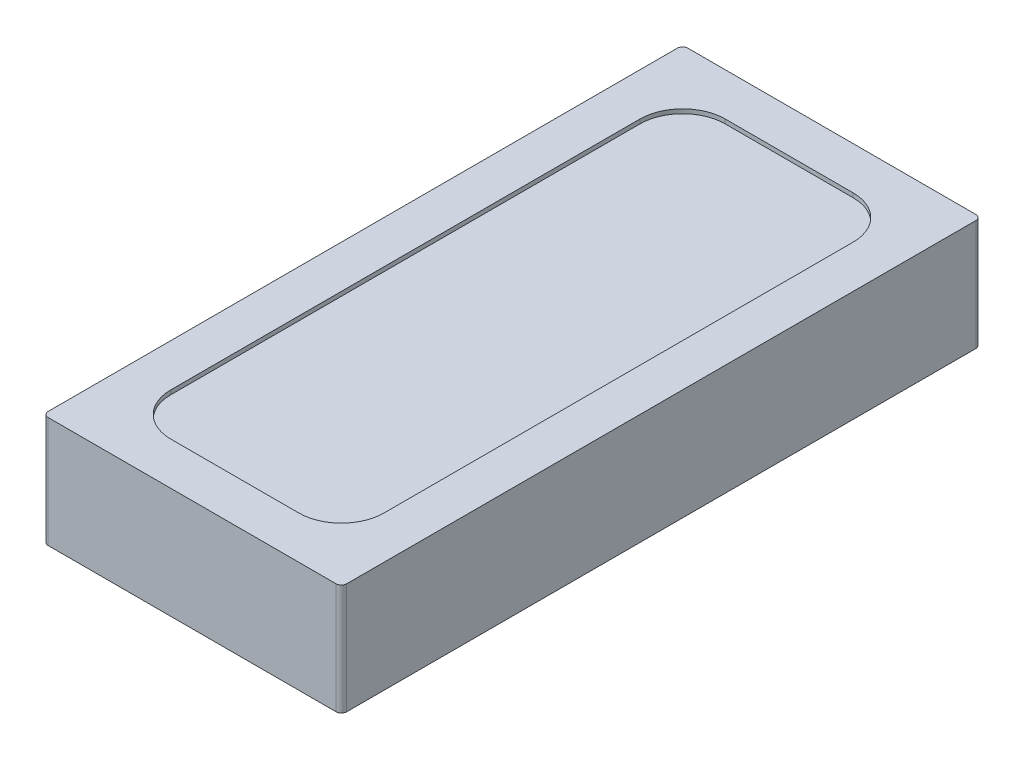
ISO-10303-21;
HEADER;
FILE_DESCRIPTION(('STEP AP214'),'2;1');
FILE_NAME('part.step','',(''),(''),'','','');
FILE_SCHEMA(('AUTOMOTIVE_DESIGN { 1 0 10303 214 1 1 1 1 }'));
ENDSEC;
DATA;
#1=APPLICATION_CONTEXT('core data for automotive mechanical design processes');
#2=APPLICATION_PROTOCOL_DEFINITION('international standard','automotive_design',2000,#1);
#3=PRODUCT_CONTEXT('',#1,'mechanical');
#4=PRODUCT('Part','Part','',(#3));
#5=PRODUCT_RELATED_PRODUCT_CATEGORY('part','',(#4));
#6=PRODUCT_DEFINITION_FORMATION('','',#4);
#7=PRODUCT_DEFINITION_CONTEXT('part definition',#1,'design');
#8=PRODUCT_DEFINITION('design','',#6,#7);
#9=PRODUCT_DEFINITION_SHAPE('','',#8);
#10=(LENGTH_UNIT() NAMED_UNIT(*) SI_UNIT(.MILLI.,.METRE.));
#11=(NAMED_UNIT(*) PLANE_ANGLE_UNIT() SI_UNIT($,.RADIAN.));
#12=(NAMED_UNIT(*) SI_UNIT($,.STERADIAN.) SOLID_ANGLE_UNIT());
#13=UNCERTAINTY_MEASURE_WITH_UNIT(LENGTH_MEASURE(1.E-05),#10,'distance_accuracy_value','');
#14=(GEOMETRIC_REPRESENTATION_CONTEXT(3) GLOBAL_UNCERTAINTY_ASSIGNED_CONTEXT((#13)) GLOBAL_UNIT_ASSIGNED_CONTEXT((#10,
#11,#12)) REPRESENTATION_CONTEXT('',''));
#15=CARTESIAN_POINT('',(0.,0.,0.));
#16=DIRECTION('',(0.,0.,1.));
#17=DIRECTION('',(1.,0.,0.));
#18=AXIS2_PLACEMENT_3D('',#15,#16,#17);
#19=CARTESIAN_POINT('',(-0.675,0.52,-1.475));
#20=DIRECTION('',(0.,-1.,0.));
#21=DIRECTION('',(0.,0.,-1.));
#22=AXIS2_PLACEMENT_3D('',#19,#20,#21);
#23=CYLINDRICAL_SURFACE('',#22,0.025);
#24=CARTESIAN_POINT('',(-0.675,0.,-1.475));
#25=DIRECTION('',(0.,1.,0.));
#26=DIRECTION('',(0.,0.,-1.));
#27=AXIS2_PLACEMENT_3D('',#24,#25,#26);
#28=CIRCLE('',#27,0.025);
#29=CARTESIAN_POINT('',(-0.675,0.,-1.5));
#30=VERTEX_POINT('',#29);
#31=CARTESIAN_POINT('',(-0.7,0.,-1.475));
#32=VERTEX_POINT('',#31);
#33=EDGE_CURVE('E142',#30,#32,#28,.T.);
#34=ORIENTED_EDGE('',*,*,#33,.T.);
#35=DIRECTION('',(0.,-1.,0.));
#36=VECTOR('',#35,1.);
#37=CARTESIAN_POINT('',(-0.7,0.52,-1.475));
#38=LINE('',#37,#36);
#39=CARTESIAN_POINT('',(-0.7,0.52,-1.475));
#40=VERTEX_POINT('',#39);
#41=EDGE_CURVE('E11',#40,#32,#38,.T.);
#42=ORIENTED_EDGE('',*,*,#41,.F.);
#43=CARTESIAN_POINT('',(-0.675,0.52,-1.475));
#44=DIRECTION('',(0.,1.,0.));
#45=DIRECTION('',(0.,0.,-1.));
#46=AXIS2_PLACEMENT_3D('',#43,#44,#45);
#47=CIRCLE('',#46,0.025);
#48=CARTESIAN_POINT('',(-0.675,0.52,-1.5));
#49=VERTEX_POINT('',#48);
#50=EDGE_CURVE('E158',#49,#40,#47,.T.);
#51=ORIENTED_EDGE('',*,*,#50,.F.);
#52=DIRECTION('',(0.,-1.,0.));
#53=VECTOR('',#52,1.);
#54=CARTESIAN_POINT('',(-0.675,0.52,-1.5));
#55=LINE('',#54,#53);
#56=EDGE_CURVE('E138',#49,#30,#55,.T.);
#57=ORIENTED_EDGE('',*,*,#56,.T.);
#58=EDGE_LOOP('',(#34,#42,#51,#57));
#59=FACE_BOUND('',#58,.T.);
#60=ADVANCED_FACE('F34',(#59),#23,.T.);
#61=CARTESIAN_POINT('',(-0.7,0.52,1.475));
#62=DIRECTION('',(1.,0.,0.));
#63=DIRECTION('',(0.,0.,-1.));
#64=AXIS2_PLACEMENT_3D('',#61,#62,#63);
#65=PLANE('',#64);
#66=DIRECTION('',(0.,0.,1.));
#67=VECTOR('',#66,1.);
#68=CARTESIAN_POINT('',(-0.7,0.,1.475));
#69=LINE('',#68,#67);
#70=CARTESIAN_POINT('',(-0.7,0.,1.475));
#71=VERTEX_POINT('',#70);
#72=EDGE_CURVE('E145',#32,#71,#69,.T.);
#73=ORIENTED_EDGE('',*,*,#72,.T.);
#74=DIRECTION('',(0.,-1.,0.));
#75=VECTOR('',#74,1.);
#76=CARTESIAN_POINT('',(-0.7,0.52,1.475));
#77=LINE('',#76,#75);
#78=CARTESIAN_POINT('',(-0.7,0.52,1.475));
#79=VERTEX_POINT('',#78);
#80=EDGE_CURVE('E41',#79,#71,#77,.T.);
#81=ORIENTED_EDGE('',*,*,#80,.F.);
#82=DIRECTION('',(0.,0.,1.));
#83=VECTOR('',#82,1.);
#84=CARTESIAN_POINT('',(-0.7,0.52,1.475));
#85=LINE('',#84,#83);
#86=EDGE_CURVE('E98',#40,#79,#85,.T.);
#87=ORIENTED_EDGE('',*,*,#86,.F.);
#88=ORIENTED_EDGE('',*,*,#41,.T.);
#89=EDGE_LOOP('',(#73,#81,#87,#88));
#90=FACE_BOUND('',#89,.T.);
#91=ADVANCED_FACE('F332',(#90),#65,.F.);
#92=CARTESIAN_POINT('',(-0.675,0.52,1.475));
#93=DIRECTION('',(0.,-1.,0.));
#94=DIRECTION('',(0.,0.,-1.));
#95=AXIS2_PLACEMENT_3D('',#92,#93,#94);
#96=CYLINDRICAL_SURFACE('',#95,0.025);
#97=CARTESIAN_POINT('',(-0.675,0.,1.475));
#98=DIRECTION('',(0.,1.,0.));
#99=DIRECTION('',(0.,0.,-1.));
#100=AXIS2_PLACEMENT_3D('',#97,#98,#99);
#101=CIRCLE('',#100,0.025);
#102=CARTESIAN_POINT('',(-0.675,0.,1.5));
#103=VERTEX_POINT('',#102);
#104=EDGE_CURVE('E148',#71,#103,#101,.T.);
#105=ORIENTED_EDGE('',*,*,#104,.T.);
#106=DIRECTION('',(0.,-1.,0.));
#107=VECTOR('',#106,1.);
#108=CARTESIAN_POINT('',(-0.675,0.52,1.5));
#109=LINE('',#108,#107);
#110=CARTESIAN_POINT('',(-0.675,0.52,1.5));
#111=VERTEX_POINT('',#110);
#112=EDGE_CURVE('E165',#111,#103,#109,.T.);
#113=ORIENTED_EDGE('',*,*,#112,.F.);
#114=CARTESIAN_POINT('',(-0.675,0.52,1.475));
#115=DIRECTION('',(0.,1.,0.));
#116=DIRECTION('',(0.,0.,-1.));
#117=AXIS2_PLACEMENT_3D('',#114,#115,#116);
#118=CIRCLE('',#117,0.025);
#119=EDGE_CURVE('E173',#79,#111,#118,.T.);
#120=ORIENTED_EDGE('',*,*,#119,.F.);
#121=ORIENTED_EDGE('',*,*,#80,.T.);
#122=EDGE_LOOP('',(#105,#113,#120,#121));
#123=FACE_BOUND('',#122,.T.);
#124=ADVANCED_FACE('F171',(#123),#96,.T.);
#125=CARTESIAN_POINT('',(-0.675,0.52,1.5));
#126=DIRECTION('',(0.,0.,-1.));
#127=DIRECTION('',(-1.,0.,0.));
#128=AXIS2_PLACEMENT_3D('',#125,#126,#127);
#129=PLANE('',#128);
#130=DIRECTION('',(1.,0.,0.));
#131=VECTOR('',#130,1.);
#132=CARTESIAN_POINT('',(-0.675,0.,1.5));
#133=LINE('',#132,#131);
#134=CARTESIAN_POINT('',(0.675,0.,1.5));
#135=VERTEX_POINT('',#134);
#136=EDGE_CURVE('E150',#103,#135,#133,.T.);
#137=ORIENTED_EDGE('',*,*,#136,.T.);
#138=DIRECTION('',(0.,-1.,0.));
#139=VECTOR('',#138,1.);
#140=CARTESIAN_POINT('',(0.675,0.52,1.5));
#141=LINE('',#140,#139);
#142=CARTESIAN_POINT('',(0.675,0.52,1.5));
#143=VERTEX_POINT('',#142);
#144=EDGE_CURVE('E162',#143,#135,#141,.T.);
#145=ORIENTED_EDGE('',*,*,#144,.F.);
#146=DIRECTION('',(1.,0.,0.));
#147=VECTOR('',#146,1.);
#148=CARTESIAN_POINT('',(-0.675,0.52,1.5));
#149=LINE('',#148,#147);
#150=EDGE_CURVE('E185',#111,#143,#149,.T.);
#151=ORIENTED_EDGE('',*,*,#150,.F.);
#152=ORIENTED_EDGE('',*,*,#112,.T.);
#153=EDGE_LOOP('',(#137,#145,#151,#152));
#154=FACE_BOUND('',#153,.T.);
#155=ADVANCED_FACE('F181',(#154),#129,.F.);
#156=CARTESIAN_POINT('',(0.675,0.52,1.475));
#157=DIRECTION('',(0.,-1.,0.));
#158=DIRECTION('',(0.,0.,-1.));
#159=AXIS2_PLACEMENT_3D('',#156,#157,#158);
#160=CYLINDRICAL_SURFACE('',#159,0.025);
#161=CARTESIAN_POINT('',(0.675,0.,1.475));
#162=DIRECTION('',(0.,1.,0.));
#163=DIRECTION('',(0.,0.,1.));
#164=AXIS2_PLACEMENT_3D('',#161,#162,#163);
#165=CIRCLE('',#164,0.025);
#166=CARTESIAN_POINT('',(0.7,0.,1.475));
#167=VERTEX_POINT('',#166);
#168=EDGE_CURVE('E152',#135,#167,#165,.T.);
#169=ORIENTED_EDGE('',*,*,#168,.T.);
#170=DIRECTION('',(0.,-1.,0.));
#171=VECTOR('',#170,1.);
#172=CARTESIAN_POINT('',(0.7,0.52,1.475));
#173=LINE('',#172,#171);
#174=CARTESIAN_POINT('',(0.7,0.52,1.475));
#175=VERTEX_POINT('',#174);
#176=EDGE_CURVE('E133',#175,#167,#173,.T.);
#177=ORIENTED_EDGE('',*,*,#176,.F.);
#178=CARTESIAN_POINT('',(0.675,0.52,1.475));
#179=DIRECTION('',(0.,1.,0.));
#180=DIRECTION('',(0.,0.,1.));
#181=AXIS2_PLACEMENT_3D('',#178,#179,#180);
#182=CIRCLE('',#181,0.025);
#183=EDGE_CURVE('E121',#143,#175,#182,.T.);
#184=ORIENTED_EDGE('',*,*,#183,.F.);
#185=ORIENTED_EDGE('',*,*,#144,.T.);
#186=EDGE_LOOP('',(#169,#177,#184,#185));
#187=FACE_BOUND('',#186,.T.);
#188=ADVANCED_FACE('F184',(#187),#160,.T.);
#189=CARTESIAN_POINT('',(0.7,0.52,1.475));
#190=DIRECTION('',(-1.,0.,0.));
#191=DIRECTION('',(0.,0.,1.));
#192=AXIS2_PLACEMENT_3D('',#189,#190,#191);
#193=PLANE('',#192);
#194=DIRECTION('',(0.,0.,-1.));
#195=VECTOR('',#194,1.);
#196=CARTESIAN_POINT('',(0.7,0.,1.475));
#197=LINE('',#196,#195);
#198=CARTESIAN_POINT('',(0.7,0.,-1.475));
#199=VERTEX_POINT('',#198);
#200=EDGE_CURVE('E130',#167,#199,#197,.T.);
#201=ORIENTED_EDGE('',*,*,#200,.T.);
#202=DIRECTION('',(0.,-1.,0.));
#203=VECTOR('',#202,1.);
#204=CARTESIAN_POINT('',(0.7,0.52,-1.475));
#205=LINE('',#204,#203);
#206=CARTESIAN_POINT('',(0.7,0.52,-1.475));
#207=VERTEX_POINT('',#206);
#208=EDGE_CURVE('E127',#207,#199,#205,.T.);
#209=ORIENTED_EDGE('',*,*,#208,.F.);
#210=DIRECTION('',(0.,0.,-1.));
#211=VECTOR('',#210,1.);
#212=CARTESIAN_POINT('',(0.7,0.52,1.475));
#213=LINE('',#212,#211);
#214=EDGE_CURVE('E114',#175,#207,#213,.T.);
#215=ORIENTED_EDGE('',*,*,#214,.F.);
#216=ORIENTED_EDGE('',*,*,#176,.T.);
#217=EDGE_LOOP('',(#201,#209,#215,#216));
#218=FACE_BOUND('',#217,.T.);
#219=ADVANCED_FACE('F128',(#218),#193,.F.);
#220=CARTESIAN_POINT('',(0.675,0.52,-1.475));
#221=DIRECTION('',(0.,-1.,0.));
#222=DIRECTION('',(0.,0.,-1.));
#223=AXIS2_PLACEMENT_3D('',#220,#221,#222);
#224=CYLINDRICAL_SURFACE('',#223,0.025);
#225=CARTESIAN_POINT('',(0.675,0.,-1.475));
#226=DIRECTION('',(0.,1.,0.));
#227=DIRECTION('',(0.,0.,-1.));
#228=AXIS2_PLACEMENT_3D('',#225,#226,#227);
#229=CIRCLE('',#228,0.025);
#230=CARTESIAN_POINT('',(0.675,0.,-1.5));
#231=VERTEX_POINT('',#230);
#232=EDGE_CURVE('E155',#199,#231,#229,.T.);
#233=ORIENTED_EDGE('',*,*,#232,.T.);
#234=DIRECTION('',(0.,-1.,0.));
#235=VECTOR('',#234,1.);
#236=CARTESIAN_POINT('',(0.675,0.52,-1.5));
#237=LINE('',#236,#235);
#238=CARTESIAN_POINT('',(0.675,0.52,-1.5));
#239=VERTEX_POINT('',#238);
#240=EDGE_CURVE('E134',#239,#231,#237,.T.);
#241=ORIENTED_EDGE('',*,*,#240,.F.);
#242=CARTESIAN_POINT('',(0.675,0.52,-1.475));
#243=DIRECTION('',(0.,1.,0.));
#244=DIRECTION('',(0.,0.,-1.));
#245=AXIS2_PLACEMENT_3D('',#242,#243,#244);
#246=CIRCLE('',#245,0.025);
#247=EDGE_CURVE('E118',#207,#239,#246,.T.);
#248=ORIENTED_EDGE('',*,*,#247,.F.);
#249=ORIENTED_EDGE('',*,*,#208,.T.);
#250=EDGE_LOOP('',(#233,#241,#248,#249));
#251=FACE_BOUND('',#250,.T.);
#252=ADVANCED_FACE('F136',(#251),#224,.T.);
#253=CARTESIAN_POINT('',(-0.675,0.52,-1.5));
#254=DIRECTION('',(0.,0.,1.));
#255=DIRECTION('',(1.,0.,0.));
#256=AXIS2_PLACEMENT_3D('',#253,#254,#255);
#257=PLANE('',#256);
#258=DIRECTION('',(-1.,0.,0.));
#259=VECTOR('',#258,1.);
#260=CARTESIAN_POINT('',(-0.675,0.,-1.5));
#261=LINE('',#260,#259);
#262=EDGE_CURVE('E90',#231,#30,#261,.T.);
#263=ORIENTED_EDGE('',*,*,#262,.T.);
#264=ORIENTED_EDGE('',*,*,#56,.F.);
#265=DIRECTION('',(-1.,0.,0.));
#266=VECTOR('',#265,1.);
#267=CARTESIAN_POINT('',(-0.675,0.52,-1.5));
#268=LINE('',#267,#266);
#269=EDGE_CURVE('E57',#239,#49,#268,.T.);
#270=ORIENTED_EDGE('',*,*,#269,.F.);
#271=ORIENTED_EDGE('',*,*,#240,.T.);
#272=EDGE_LOOP('',(#263,#264,#270,#271));
#273=FACE_BOUND('',#272,.T.);
#274=ADVANCED_FACE('F339',(#273),#257,.F.);
#275=CARTESIAN_POINT('',(-0.675,0.52,-1.475));
#276=DIRECTION('',(0.,-1.,0.));
#277=DIRECTION('',(0.,0.,-1.));
#278=AXIS2_PLACEMENT_3D('',#275,#276,#277);
#279=PLANE('',#278);
#280=DIRECTION('',(0.,0.,-1.));
#281=VECTOR('',#280,1.);
#282=CARTESIAN_POINT('',(0.5,0.52,1.1));
#283=LINE('',#282,#281);
#284=CARTESIAN_POINT('',(0.5,0.52,1.1));
#285=VERTEX_POINT('',#284);
#286=CARTESIAN_POINT('',(0.5,0.52,-1.1));
#287=VERTEX_POINT('',#286);
#288=EDGE_CURVE('E232',#285,#287,#283,.T.);
#289=ORIENTED_EDGE('',*,*,#288,.F.);
#290=CARTESIAN_POINT('',(0.3,0.52,1.1));
#291=DIRECTION('',(0.,1.,0.));
#292=DIRECTION('',(0.,0.,1.));
#293=AXIS2_PLACEMENT_3D('',#290,#291,#292);
#294=CIRCLE('',#293,0.2);
#295=CARTESIAN_POINT('',(0.299999999999999,0.52,1.3));
#296=VERTEX_POINT('',#295);
#297=EDGE_CURVE('E48',#296,#285,#294,.T.);
#298=ORIENTED_EDGE('',*,*,#297,.F.);
#299=DIRECTION('',(1.,0.,0.));
#300=VECTOR('',#299,1.);
#301=CARTESIAN_POINT('',(-0.299999999999999,0.52,1.3));
#302=LINE('',#301,#300);
#303=CARTESIAN_POINT('',(-0.299999999999999,0.52,1.3));
#304=VERTEX_POINT('',#303);
#305=EDGE_CURVE('E213',#304,#296,#302,.T.);
#306=ORIENTED_EDGE('',*,*,#305,.F.);
#307=CARTESIAN_POINT('',(-0.3,0.52,1.1));
#308=DIRECTION('',(0.,1.,0.));
#309=DIRECTION('',(0.,0.,-1.));
#310=AXIS2_PLACEMENT_3D('',#307,#308,#309);
#311=CIRCLE('',#310,0.2);
#312=CARTESIAN_POINT('',(-0.5,0.52,1.1));
#313=VERTEX_POINT('',#312);
#314=EDGE_CURVE('E217',#313,#304,#311,.T.);
#315=ORIENTED_EDGE('',*,*,#314,.F.);
#316=DIRECTION('',(0.,0.,1.));
#317=VECTOR('',#316,1.);
#318=CARTESIAN_POINT('',(-0.5,0.52,1.1));
#319=LINE('',#318,#317);
#320=CARTESIAN_POINT('',(-0.5,0.52,-1.1));
#321=VERTEX_POINT('',#320);
#322=EDGE_CURVE('E220',#321,#313,#319,.T.);
#323=ORIENTED_EDGE('',*,*,#322,.F.);
#324=CARTESIAN_POINT('',(-0.3,0.52,-1.1));
#325=DIRECTION('',(0.,1.,0.));
#326=DIRECTION('',(0.,0.,-1.));
#327=AXIS2_PLACEMENT_3D('',#324,#325,#326);
#328=CIRCLE('',#327,0.2);
#329=CARTESIAN_POINT('',(-0.3,0.52,-1.3));
#330=VERTEX_POINT('',#329);
#331=EDGE_CURVE('E223',#330,#321,#328,.T.);
#332=ORIENTED_EDGE('',*,*,#331,.F.);
#333=DIRECTION('',(-1.,0.,0.));
#334=VECTOR('',#333,1.);
#335=CARTESIAN_POINT('',(-0.299999999999999,0.52,-1.3));
#336=LINE('',#335,#334);
#337=CARTESIAN_POINT('',(0.299999999999999,0.52,-1.3));
#338=VERTEX_POINT('',#337);
#339=EDGE_CURVE('E226',#338,#330,#336,.T.);
#340=ORIENTED_EDGE('',*,*,#339,.F.);
#341=CARTESIAN_POINT('',(0.3,0.52,-1.1));
#342=DIRECTION('',(0.,1.,0.));
#343=DIRECTION('',(0.,0.,-1.));
#344=AXIS2_PLACEMENT_3D('',#341,#342,#343);
#345=CIRCLE('',#344,0.2);
#346=EDGE_CURVE('E229',#287,#338,#345,.T.);
#347=ORIENTED_EDGE('',*,*,#346,.F.);
#348=EDGE_LOOP('',(#289,#298,#306,#315,#323,#332,#340,#347));
#349=FACE_BOUND('',#348,.T.);
#350=ORIENTED_EDGE('',*,*,#50,.T.);
#351=ORIENTED_EDGE('',*,*,#86,.T.);
#352=ORIENTED_EDGE('',*,*,#119,.T.);
#353=ORIENTED_EDGE('',*,*,#150,.T.);
#354=ORIENTED_EDGE('',*,*,#183,.T.);
#355=ORIENTED_EDGE('',*,*,#214,.T.);
#356=ORIENTED_EDGE('',*,*,#247,.T.);
#357=ORIENTED_EDGE('',*,*,#269,.T.);
#358=EDGE_LOOP('',(#350,#351,#352,#353,#354,#355,#356,#357));
#359=FACE_BOUND('',#358,.T.);
#360=ADVANCED_FACE('F116',(#349,#359),#279,.F.);
#361=CARTESIAN_POINT('',(-0.675,0.,-1.475));
#362=DIRECTION('',(0.,-1.,0.));
#363=DIRECTION('',(0.,0.,-1.));
#364=AXIS2_PLACEMENT_3D('',#361,#362,#363);
#365=PLANE('',#364);
#366=ORIENTED_EDGE('',*,*,#33,.F.);
#367=ORIENTED_EDGE('',*,*,#262,.F.);
#368=ORIENTED_EDGE('',*,*,#232,.F.);
#369=ORIENTED_EDGE('',*,*,#200,.F.);
#370=ORIENTED_EDGE('',*,*,#168,.F.);
#371=ORIENTED_EDGE('',*,*,#136,.F.);
#372=ORIENTED_EDGE('',*,*,#104,.F.);
#373=ORIENTED_EDGE('',*,*,#72,.F.);
#374=EDGE_LOOP('',(#366,#367,#368,#369,#370,#371,#372,#373));
#375=FACE_BOUND('',#374,.T.);
#376=ADVANCED_FACE('F177',(#375),#365,.T.);
#377=CARTESIAN_POINT('',(0.3,0.5,1.1));
#378=DIRECTION('',(0.,1.,0.));
#379=DIRECTION('',(0.,0.,1.));
#380=AXIS2_PLACEMENT_3D('',#377,#378,#379);
#381=CYLINDRICAL_SURFACE('',#380,0.2);
#382=ORIENTED_EDGE('',*,*,#297,.T.);
#383=DIRECTION('',(0.,1.,0.));
#384=VECTOR('',#383,1.);
#385=CARTESIAN_POINT('',(0.5,0.5,1.1));
#386=LINE('',#385,#384);
#387=CARTESIAN_POINT('',(0.5,0.5,1.1));
#388=VERTEX_POINT('',#387);
#389=EDGE_CURVE('E191',#388,#285,#386,.T.);
#390=ORIENTED_EDGE('',*,*,#389,.F.);
#391=CARTESIAN_POINT('',(0.3,0.5,1.1));
#392=DIRECTION('',(0.,1.,0.));
#393=DIRECTION('',(0.,0.,1.));
#394=AXIS2_PLACEMENT_3D('',#391,#392,#393);
#395=CIRCLE('',#394,0.2);
#396=CARTESIAN_POINT('',(0.299999999999999,0.5,1.3));
#397=VERTEX_POINT('',#396);
#398=EDGE_CURVE('E216',#397,#388,#395,.T.);
#399=ORIENTED_EDGE('',*,*,#398,.F.);
#400=DIRECTION('',(0.,1.,0.));
#401=VECTOR('',#400,1.);
#402=CARTESIAN_POINT('',(0.299999999999999,0.5,1.3));
#403=LINE('',#402,#401);
#404=EDGE_CURVE('E146',#397,#296,#403,.T.);
#405=ORIENTED_EDGE('',*,*,#404,.T.);
#406=EDGE_LOOP('',(#382,#390,#399,#405));
#407=FACE_BOUND('',#406,.T.);
#408=ADVANCED_FACE('F265',(#407),#381,.F.);
#409=CARTESIAN_POINT('',(-0.299999999999999,0.5,1.3));
#410=DIRECTION('',(0.,0.,1.));
#411=DIRECTION('',(1.,0.,0.));
#412=AXIS2_PLACEMENT_3D('',#409,#410,#411);
#413=PLANE('',#412);
#414=ORIENTED_EDGE('',*,*,#305,.T.);
#415=ORIENTED_EDGE('',*,*,#404,.F.);
#416=DIRECTION('',(1.,0.,0.));
#417=VECTOR('',#416,1.);
#418=CARTESIAN_POINT('',(-0.299999999999999,0.5,1.3));
#419=LINE('',#418,#417);
#420=CARTESIAN_POINT('',(-0.299999999999999,0.5,1.3));
#421=VERTEX_POINT('',#420);
#422=EDGE_CURVE('E194',#421,#397,#419,.T.);
#423=ORIENTED_EDGE('',*,*,#422,.F.);
#424=DIRECTION('',(0.,1.,0.));
#425=VECTOR('',#424,1.);
#426=CARTESIAN_POINT('',(-0.299999999999999,0.5,1.3));
#427=LINE('',#426,#425);
#428=EDGE_CURVE('E209',#421,#304,#427,.T.);
#429=ORIENTED_EDGE('',*,*,#428,.T.);
#430=EDGE_LOOP('',(#414,#415,#423,#429));
#431=FACE_BOUND('',#430,.T.);
#432=ADVANCED_FACE('F285',(#431),#413,.F.);
#433=CARTESIAN_POINT('',(-0.3,0.5,1.1));
#434=DIRECTION('',(0.,1.,0.));
#435=DIRECTION('',(0.,0.,1.));
#436=AXIS2_PLACEMENT_3D('',#433,#434,#435);
#437=CYLINDRICAL_SURFACE('',#436,0.2);
#438=ORIENTED_EDGE('',*,*,#314,.T.);
#439=ORIENTED_EDGE('',*,*,#428,.F.);
#440=CARTESIAN_POINT('',(-0.3,0.5,1.1));
#441=DIRECTION('',(0.,1.,0.));
#442=DIRECTION('',(0.,0.,-1.));
#443=AXIS2_PLACEMENT_3D('',#440,#441,#442);
#444=CIRCLE('',#443,0.2);
#445=CARTESIAN_POINT('',(-0.5,0.5,1.1));
#446=VERTEX_POINT('',#445);
#447=EDGE_CURVE('E238',#446,#421,#444,.T.);
#448=ORIENTED_EDGE('',*,*,#447,.F.);
#449=DIRECTION('',(0.,1.,0.));
#450=VECTOR('',#449,1.);
#451=CARTESIAN_POINT('',(-0.5,0.5,1.1));
#452=LINE('',#451,#450);
#453=EDGE_CURVE('E206',#446,#313,#452,.T.);
#454=ORIENTED_EDGE('',*,*,#453,.T.);
#455=EDGE_LOOP('',(#438,#439,#448,#454));
#456=FACE_BOUND('',#455,.T.);
#457=ADVANCED_FACE('F290',(#456),#437,.F.);
#458=CARTESIAN_POINT('',(-0.5,0.5,1.1));
#459=DIRECTION('',(-1.,0.,0.));
#460=DIRECTION('',(0.,0.,1.));
#461=AXIS2_PLACEMENT_3D('',#458,#459,#460);
#462=PLANE('',#461);
#463=ORIENTED_EDGE('',*,*,#322,.T.);
#464=ORIENTED_EDGE('',*,*,#453,.F.);
#465=DIRECTION('',(0.,0.,1.));
#466=VECTOR('',#465,1.);
#467=CARTESIAN_POINT('',(-0.5,0.5,1.1));
#468=LINE('',#467,#466);
#469=CARTESIAN_POINT('',(-0.5,0.5,-1.1));
#470=VERTEX_POINT('',#469);
#471=EDGE_CURVE('E241',#470,#446,#468,.T.);
#472=ORIENTED_EDGE('',*,*,#471,.F.);
#473=DIRECTION('',(0.,1.,0.));
#474=VECTOR('',#473,1.);
#475=CARTESIAN_POINT('',(-0.5,0.5,-1.1));
#476=LINE('',#475,#474);
#477=EDGE_CURVE('E203',#470,#321,#476,.T.);
#478=ORIENTED_EDGE('',*,*,#477,.T.);
#479=EDGE_LOOP('',(#463,#464,#472,#478));
#480=FACE_BOUND('',#479,.T.);
#481=ADVANCED_FACE('F316',(#480),#462,.F.);
#482=CARTESIAN_POINT('',(-0.3,0.5,-1.1));
#483=DIRECTION('',(0.,1.,0.));
#484=DIRECTION('',(0.,0.,1.));
#485=AXIS2_PLACEMENT_3D('',#482,#483,#484);
#486=CYLINDRICAL_SURFACE('',#485,0.2);
#487=ORIENTED_EDGE('',*,*,#331,.T.);
#488=ORIENTED_EDGE('',*,*,#477,.F.);
#489=CARTESIAN_POINT('',(-0.3,0.5,-1.1));
#490=DIRECTION('',(0.,1.,0.));
#491=DIRECTION('',(0.,0.,-1.));
#492=AXIS2_PLACEMENT_3D('',#489,#490,#491);
#493=CIRCLE('',#492,0.2);
#494=CARTESIAN_POINT('',(-0.3,0.5,-1.3));
#495=VERTEX_POINT('',#494);
#496=EDGE_CURVE('E244',#495,#470,#493,.T.);
#497=ORIENTED_EDGE('',*,*,#496,.F.);
#498=DIRECTION('',(0.,1.,0.));
#499=VECTOR('',#498,1.);
#500=CARTESIAN_POINT('',(-0.3,0.5,-1.3));
#501=LINE('',#500,#499);
#502=EDGE_CURVE('E200',#495,#330,#501,.T.);
#503=ORIENTED_EDGE('',*,*,#502,.T.);
#504=EDGE_LOOP('',(#487,#488,#497,#503));
#505=FACE_BOUND('',#504,.T.);
#506=ADVANCED_FACE('F319',(#505),#486,.F.);
#507=CARTESIAN_POINT('',(-0.299999999999999,0.5,-1.3));
#508=DIRECTION('',(0.,0.,-1.));
#509=DIRECTION('',(-1.,0.,0.));
#510=AXIS2_PLACEMENT_3D('',#507,#508,#509);
#511=PLANE('',#510);
#512=ORIENTED_EDGE('',*,*,#339,.T.);
#513=ORIENTED_EDGE('',*,*,#502,.F.);
#514=DIRECTION('',(-1.,0.,0.));
#515=VECTOR('',#514,1.);
#516=CARTESIAN_POINT('',(-0.299999999999999,0.5,-1.3));
#517=LINE('',#516,#515);
#518=CARTESIAN_POINT('',(0.299999999999999,0.5,-1.3));
#519=VERTEX_POINT('',#518);
#520=EDGE_CURVE('E247',#519,#495,#517,.T.);
#521=ORIENTED_EDGE('',*,*,#520,.F.);
#522=DIRECTION('',(0.,1.,0.));
#523=VECTOR('',#522,1.);
#524=CARTESIAN_POINT('',(0.299999999999999,0.5,-1.3));
#525=LINE('',#524,#523);
#526=EDGE_CURVE('E197',#519,#338,#525,.T.);
#527=ORIENTED_EDGE('',*,*,#526,.T.);
#528=EDGE_LOOP('',(#512,#513,#521,#527));
#529=FACE_BOUND('',#528,.T.);
#530=ADVANCED_FACE('F322',(#529),#511,.F.);
#531=CARTESIAN_POINT('',(0.3,0.5,-1.1));
#532=DIRECTION('',(0.,1.,0.));
#533=DIRECTION('',(0.,0.,1.));
#534=AXIS2_PLACEMENT_3D('',#531,#532,#533);
#535=CYLINDRICAL_SURFACE('',#534,0.2);
#536=ORIENTED_EDGE('',*,*,#346,.T.);
#537=ORIENTED_EDGE('',*,*,#526,.F.);
#538=CARTESIAN_POINT('',(0.3,0.5,-1.1));
#539=DIRECTION('',(0.,1.,0.));
#540=DIRECTION('',(0.,0.,-1.));
#541=AXIS2_PLACEMENT_3D('',#538,#539,#540);
#542=CIRCLE('',#541,0.2);
#543=CARTESIAN_POINT('',(0.5,0.5,-1.1));
#544=VERTEX_POINT('',#543);
#545=EDGE_CURVE('E250',#544,#519,#542,.T.);
#546=ORIENTED_EDGE('',*,*,#545,.F.);
#547=DIRECTION('',(0.,1.,0.));
#548=VECTOR('',#547,1.);
#549=CARTESIAN_POINT('',(0.5,0.5,-1.1));
#550=LINE('',#549,#548);
#551=EDGE_CURVE('E193',#544,#287,#550,.T.);
#552=ORIENTED_EDGE('',*,*,#551,.T.);
#553=EDGE_LOOP('',(#536,#537,#546,#552));
#554=FACE_BOUND('',#553,.T.);
#555=ADVANCED_FACE('F305',(#554),#535,.F.);
#556=CARTESIAN_POINT('',(0.5,0.5,1.1));
#557=DIRECTION('',(1.,0.,0.));
#558=DIRECTION('',(0.,0.,-1.));
#559=AXIS2_PLACEMENT_3D('',#556,#557,#558);
#560=PLANE('',#559);
#561=ORIENTED_EDGE('',*,*,#288,.T.);
#562=ORIENTED_EDGE('',*,*,#551,.F.);
#563=DIRECTION('',(0.,0.,-1.));
#564=VECTOR('',#563,1.);
#565=CARTESIAN_POINT('',(0.5,0.5,1.1));
#566=LINE('',#565,#564);
#567=EDGE_CURVE('E253',#388,#544,#566,.T.);
#568=ORIENTED_EDGE('',*,*,#567,.F.);
#569=ORIENTED_EDGE('',*,*,#389,.T.);
#570=EDGE_LOOP('',(#561,#562,#568,#569));
#571=FACE_BOUND('',#570,.T.);
#572=ADVANCED_FACE('F299',(#571),#560,.F.);
#573=CARTESIAN_POINT('',(0.3,0.5,1.1));
#574=DIRECTION('',(0.,1.,0.));
#575=DIRECTION('',(0.,0.,1.));
#576=AXIS2_PLACEMENT_3D('',#573,#574,#575);
#577=PLANE('',#576);
#578=ORIENTED_EDGE('',*,*,#398,.T.);
#579=ORIENTED_EDGE('',*,*,#567,.T.);
#580=ORIENTED_EDGE('',*,*,#545,.T.);
#581=ORIENTED_EDGE('',*,*,#520,.T.);
#582=ORIENTED_EDGE('',*,*,#496,.T.);
#583=ORIENTED_EDGE('',*,*,#471,.T.);
#584=ORIENTED_EDGE('',*,*,#447,.T.);
#585=ORIENTED_EDGE('',*,*,#422,.T.);
#586=EDGE_LOOP('',(#578,#579,#580,#581,#582,#583,#584,#585));
#587=FACE_BOUND('',#586,.T.);
#588=ADVANCED_FACE('F260',(#587),#577,.T.);
#589=CLOSED_SHELL('',(#60,#91,#124,#155,#188,#219,#252,#274,#360,#376,#408,#432,#457,#481,#506,
#530,#555,#572,#588));
#590=MANIFOLD_SOLID_BREP('B2',#589);
#591=ADVANCED_BREP_SHAPE_REPRESENTATION('',(#18,#590),#14);
#592=SHAPE_DEFINITION_REPRESENTATION(#9,#591);
ENDSEC;
END-ISO-10303-21;
